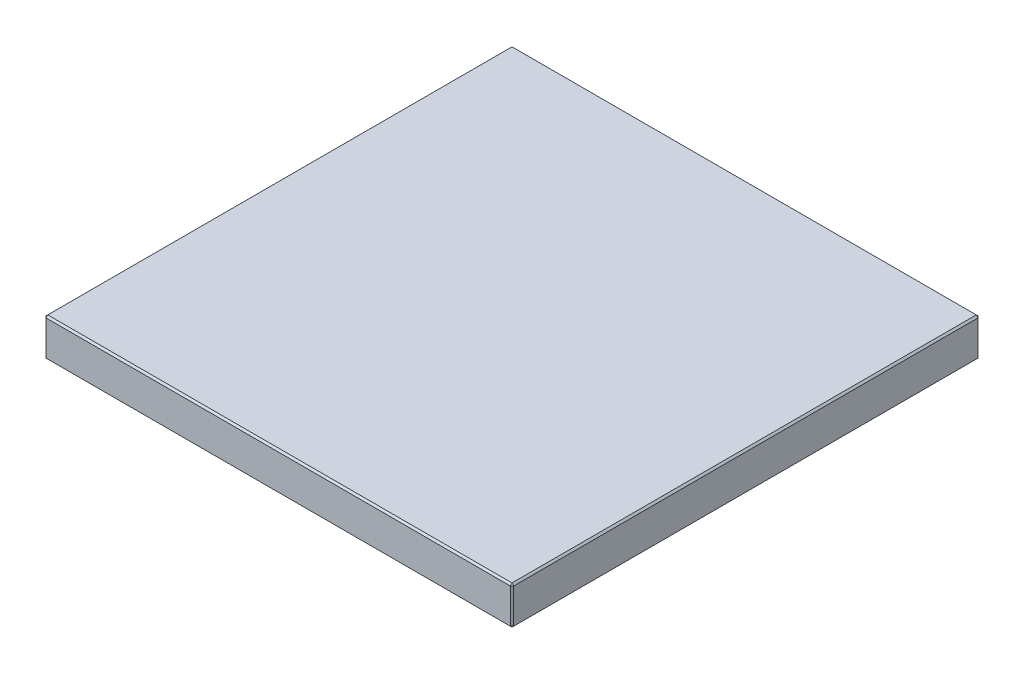
ISO-10303-21;
HEADER;
FILE_DESCRIPTION(('STEP AP214'),'2;1');
FILE_NAME('part.step','',(''),(''),'','','');
FILE_SCHEMA(('AUTOMOTIVE_DESIGN { 1 0 10303 214 1 1 1 1 }'));
ENDSEC;
DATA;
#1=APPLICATION_CONTEXT('core data for automotive mechanical design processes');
#2=APPLICATION_PROTOCOL_DEFINITION('international standard','automotive_design',2000,#1);
#3=PRODUCT_CONTEXT('',#1,'mechanical');
#4=PRODUCT('Part','Part','',(#3));
#5=PRODUCT_RELATED_PRODUCT_CATEGORY('part','',(#4));
#6=PRODUCT_DEFINITION_FORMATION('','',#4);
#7=PRODUCT_DEFINITION_CONTEXT('part definition',#1,'design');
#8=PRODUCT_DEFINITION('design','',#6,#7);
#9=PRODUCT_DEFINITION_SHAPE('','',#8);
#10=(LENGTH_UNIT() NAMED_UNIT(*) SI_UNIT(.MILLI.,.METRE.));
#11=(NAMED_UNIT(*) PLANE_ANGLE_UNIT() SI_UNIT($,.RADIAN.));
#12=(NAMED_UNIT(*) SI_UNIT($,.STERADIAN.) SOLID_ANGLE_UNIT());
#13=UNCERTAINTY_MEASURE_WITH_UNIT(LENGTH_MEASURE(1.E-05),#10,'distance_accuracy_value','');
#14=(GEOMETRIC_REPRESENTATION_CONTEXT(3) GLOBAL_UNCERTAINTY_ASSIGNED_CONTEXT((#13)) GLOBAL_UNIT_ASSIGNED_CONTEXT((#10,
#11,#12)) REPRESENTATION_CONTEXT('',''));
#15=CARTESIAN_POINT('',(0.,0.,0.));
#16=DIRECTION('',(0.,0.,1.));
#17=DIRECTION('',(1.,0.,0.));
#18=AXIS2_PLACEMENT_3D('',#15,#16,#17);
#19=CARTESIAN_POINT('',(-13.42,2.2,-13.42));
#20=DIRECTION('',(1.,0.,0.));
#21=DIRECTION('',(0.,0.,-1.));
#22=AXIS2_PLACEMENT_3D('',#19,#20,#21);
#23=PLANE('',#22);
#24=DIRECTION('',(0.,-1.,0.));
#25=VECTOR('',#24,1.);
#26=CARTESIAN_POINT('',(-13.42,2.2,-13.32));
#27=LINE('',#26,#25);
#28=CARTESIAN_POINT('',(-13.42,2.1,-13.32));
#29=VERTEX_POINT('',#28);
#30=CARTESIAN_POINT('',(-13.42,0.0999999999999994,-13.32));
#31=VERTEX_POINT('',#30);
#32=EDGE_CURVE('E140',#29,#31,#27,.T.);
#33=ORIENTED_EDGE('',*,*,#32,.T.);
#34=DIRECTION('',(0.,0.,1.));
#35=VECTOR('',#34,1.);
#36=CARTESIAN_POINT('',(-13.42,0.0999999999999994,13.42));
#37=LINE('',#36,#35);
#38=CARTESIAN_POINT('',(-13.42,0.0999999999999994,13.32));
#39=VERTEX_POINT('',#38);
#40=EDGE_CURVE('E136',#31,#39,#37,.T.);
#41=ORIENTED_EDGE('',*,*,#40,.T.);
#42=DIRECTION('',(0.,1.,0.));
#43=VECTOR('',#42,1.);
#44=CARTESIAN_POINT('',(-13.42,2.2,13.32));
#45=LINE('',#44,#43);
#46=CARTESIAN_POINT('',(-13.42,2.1,13.32));
#47=VERTEX_POINT('',#46);
#48=EDGE_CURVE('E129',#39,#47,#45,.T.);
#49=ORIENTED_EDGE('',*,*,#48,.T.);
#50=DIRECTION('',(0.,0.,-1.));
#51=VECTOR('',#50,1.);
#52=CARTESIAN_POINT('',(-13.42,2.1,-13.42));
#53=LINE('',#52,#51);
#54=EDGE_CURVE('E135',#47,#29,#53,.T.);
#55=ORIENTED_EDGE('',*,*,#54,.T.);
#56=EDGE_LOOP('',(#33,#41,#49,#55));
#57=FACE_BOUND('',#56,.T.);
#58=ADVANCED_FACE('F37',(#57),#23,.F.);
#59=CARTESIAN_POINT('',(13.42,2.2,13.42));
#60=DIRECTION('',(0.,0.,-1.));
#61=DIRECTION('',(-1.,0.,0.));
#62=AXIS2_PLACEMENT_3D('',#59,#60,#61);
#63=PLANE('',#62);
#64=DIRECTION('',(0.,-1.,0.));
#65=VECTOR('',#64,1.);
#66=CARTESIAN_POINT('',(-13.32,2.2,13.42));
#67=LINE('',#66,#65);
#68=CARTESIAN_POINT('',(-13.32,2.1,13.42));
#69=VERTEX_POINT('',#68);
#70=CARTESIAN_POINT('',(-13.32,0.0999999999999994,13.42));
#71=VERTEX_POINT('',#70);
#72=EDGE_CURVE('E146',#69,#71,#67,.T.);
#73=ORIENTED_EDGE('',*,*,#72,.T.);
#74=DIRECTION('',(1.,0.,0.));
#75=VECTOR('',#74,1.);
#76=CARTESIAN_POINT('',(13.42,0.0999999999999994,13.42));
#77=LINE('',#76,#75);
#78=CARTESIAN_POINT('',(13.32,0.0999999999999994,13.42));
#79=VERTEX_POINT('',#78);
#80=EDGE_CURVE('E189',#71,#79,#77,.T.);
#81=ORIENTED_EDGE('',*,*,#80,.T.);
#82=DIRECTION('',(0.,1.,0.));
#83=VECTOR('',#82,1.);
#84=CARTESIAN_POINT('',(13.32,2.2,13.42));
#85=LINE('',#84,#83);
#86=CARTESIAN_POINT('',(13.32,2.1,13.42));
#87=VERTEX_POINT('',#86);
#88=EDGE_CURVE('E181',#79,#87,#85,.T.);
#89=ORIENTED_EDGE('',*,*,#88,.T.);
#90=DIRECTION('',(-1.,0.,0.));
#91=VECTOR('',#90,1.);
#92=CARTESIAN_POINT('',(13.42,2.1,13.42));
#93=LINE('',#92,#91);
#94=EDGE_CURVE('E182',#87,#69,#93,.T.);
#95=ORIENTED_EDGE('',*,*,#94,.T.);
#96=EDGE_LOOP('',(#73,#81,#89,#95));
#97=FACE_BOUND('',#96,.T.);
#98=ADVANCED_FACE('F304',(#97),#63,.F.);
#99=CARTESIAN_POINT('',(13.42,2.2,-13.42));
#100=DIRECTION('',(-1.,0.,0.));
#101=DIRECTION('',(0.,0.,1.));
#102=AXIS2_PLACEMENT_3D('',#99,#100,#101);
#103=PLANE('',#102);
#104=DIRECTION('',(0.,0.,1.));
#105=VECTOR('',#104,1.);
#106=CARTESIAN_POINT('',(13.42,2.1,-13.42));
#107=LINE('',#106,#105);
#108=CARTESIAN_POINT('',(13.42,2.1,-13.32));
#109=VERTEX_POINT('',#108);
#110=CARTESIAN_POINT('',(13.42,2.1,13.32));
#111=VERTEX_POINT('',#110);
#112=EDGE_CURVE('E190',#109,#111,#107,.T.);
#113=ORIENTED_EDGE('',*,*,#112,.T.);
#114=DIRECTION('',(0.,-1.,0.));
#115=VECTOR('',#114,1.);
#116=CARTESIAN_POINT('',(13.42,2.2,13.32));
#117=LINE('',#116,#115);
#118=CARTESIAN_POINT('',(13.42,0.0999999999999994,13.32));
#119=VERTEX_POINT('',#118);
#120=EDGE_CURVE('E193',#111,#119,#117,.T.);
#121=ORIENTED_EDGE('',*,*,#120,.T.);
#122=DIRECTION('',(0.,0.,-1.));
#123=VECTOR('',#122,1.);
#124=CARTESIAN_POINT('',(13.42,0.0999999999999994,-13.42));
#125=LINE('',#124,#123);
#126=CARTESIAN_POINT('',(13.42,0.0999999999999994,-13.32));
#127=VERTEX_POINT('',#126);
#128=EDGE_CURVE('E192',#119,#127,#125,.T.);
#129=ORIENTED_EDGE('',*,*,#128,.T.);
#130=DIRECTION('',(0.,1.,0.));
#131=VECTOR('',#130,1.);
#132=CARTESIAN_POINT('',(13.42,2.2,-13.32));
#133=LINE('',#132,#131);
#134=EDGE_CURVE('E187',#127,#109,#133,.T.);
#135=ORIENTED_EDGE('',*,*,#134,.T.);
#136=EDGE_LOOP('',(#113,#121,#129,#135));
#137=FACE_BOUND('',#136,.T.);
#138=ADVANCED_FACE('F278',(#137),#103,.F.);
#139=CARTESIAN_POINT('',(13.42,2.2,-13.42));
#140=DIRECTION('',(0.,0.,1.));
#141=DIRECTION('',(1.,0.,0.));
#142=AXIS2_PLACEMENT_3D('',#139,#140,#141);
#143=PLANE('',#142);
#144=DIRECTION('',(-1.,0.,0.));
#145=VECTOR('',#144,1.);
#146=CARTESIAN_POINT('',(-13.42,0.0999999999999994,-13.42));
#147=LINE('',#146,#145);
#148=CARTESIAN_POINT('',(13.32,0.0999999999999994,-13.42));
#149=VERTEX_POINT('',#148);
#150=CARTESIAN_POINT('',(-13.32,0.0999999999999994,-13.42));
#151=VERTEX_POINT('',#150);
#152=EDGE_CURVE('E176',#149,#151,#147,.T.);
#153=ORIENTED_EDGE('',*,*,#152,.T.);
#154=DIRECTION('',(0.,1.,0.));
#155=VECTOR('',#154,1.);
#156=CARTESIAN_POINT('',(-13.32,2.2,-13.42));
#157=LINE('',#156,#155);
#158=CARTESIAN_POINT('',(-13.32,2.1,-13.42));
#159=VERTEX_POINT('',#158);
#160=EDGE_CURVE('E179',#151,#159,#157,.T.);
#161=ORIENTED_EDGE('',*,*,#160,.T.);
#162=DIRECTION('',(1.,0.,0.));
#163=VECTOR('',#162,1.);
#164=CARTESIAN_POINT('',(13.42,2.1,-13.42));
#165=LINE('',#164,#163);
#166=CARTESIAN_POINT('',(13.32,2.1,-13.42));
#167=VERTEX_POINT('',#166);
#168=EDGE_CURVE('E171',#159,#167,#165,.T.);
#169=ORIENTED_EDGE('',*,*,#168,.T.);
#170=DIRECTION('',(0.,-1.,0.));
#171=VECTOR('',#170,1.);
#172=CARTESIAN_POINT('',(13.32,2.2,-13.42));
#173=LINE('',#172,#171);
#174=EDGE_CURVE('E173',#167,#149,#173,.T.);
#175=ORIENTED_EDGE('',*,*,#174,.T.);
#176=EDGE_LOOP('',(#153,#161,#169,#175));
#177=FACE_BOUND('',#176,.T.);
#178=ADVANCED_FACE('F309',(#177),#143,.F.);
#179=CARTESIAN_POINT('',(0.,2.2,0.));
#180=DIRECTION('',(0.,-1.,0.));
#181=DIRECTION('',(0.,0.,-1.));
#182=AXIS2_PLACEMENT_3D('',#179,#180,#181);
#183=PLANE('',#182);
#184=DIRECTION('',(0.,0.,-1.));
#185=VECTOR('',#184,1.);
#186=CARTESIAN_POINT('',(13.32,2.2,0.));
#187=LINE('',#186,#185);
#188=CARTESIAN_POINT('',(13.32,2.2,13.32));
#189=VERTEX_POINT('',#188);
#190=CARTESIAN_POINT('',(13.32,2.2,-13.32));
#191=VERTEX_POINT('',#190);
#192=EDGE_CURVE('E49',#189,#191,#187,.T.);
#193=ORIENTED_EDGE('',*,*,#192,.T.);
#194=DIRECTION('',(-1.,0.,0.));
#195=VECTOR('',#194,1.);
#196=CARTESIAN_POINT('',(0.,2.2,-13.32));
#197=LINE('',#196,#195);
#198=CARTESIAN_POINT('',(-13.32,2.2,-13.32));
#199=VERTEX_POINT('',#198);
#200=EDGE_CURVE('E11',#191,#199,#197,.T.);
#201=ORIENTED_EDGE('',*,*,#200,.T.);
#202=DIRECTION('',(0.,0.,1.));
#203=VECTOR('',#202,1.);
#204=CARTESIAN_POINT('',(-13.32,2.2,0.));
#205=LINE('',#204,#203);
#206=CARTESIAN_POINT('',(-13.32,2.2,13.32));
#207=VERTEX_POINT('',#206);
#208=EDGE_CURVE('E206',#199,#207,#205,.T.);
#209=ORIENTED_EDGE('',*,*,#208,.T.);
#210=DIRECTION('',(1.,0.,0.));
#211=VECTOR('',#210,1.);
#212=CARTESIAN_POINT('',(0.,2.2,13.32));
#213=LINE('',#212,#211);
#214=EDGE_CURVE('E64',#207,#189,#213,.T.);
#215=ORIENTED_EDGE('',*,*,#214,.T.);
#216=EDGE_LOOP('',(#193,#201,#209,#215));
#217=FACE_BOUND('',#216,.T.);
#218=ADVANCED_FACE('F429',(#217),#183,.F.);
#219=CARTESIAN_POINT('',(0.,0.,0.));
#220=DIRECTION('',(0.,-1.,0.));
#221=DIRECTION('',(0.,0.,-1.));
#222=AXIS2_PLACEMENT_3D('',#219,#220,#221);
#223=PLANE('',#222);
#224=DIRECTION('',(0.,0.,1.));
#225=VECTOR('',#224,1.);
#226=CARTESIAN_POINT('',(13.32,0.,13.42));
#227=LINE('',#226,#225);
#228=CARTESIAN_POINT('',(13.32,0.,-13.32));
#229=VERTEX_POINT('',#228);
#230=CARTESIAN_POINT('',(13.32,0.,13.32));
#231=VERTEX_POINT('',#230);
#232=EDGE_CURVE('E203',#229,#231,#227,.T.);
#233=ORIENTED_EDGE('',*,*,#232,.T.);
#234=DIRECTION('',(-1.,0.,0.));
#235=VECTOR('',#234,1.);
#236=CARTESIAN_POINT('',(-13.42,0.,13.32));
#237=LINE('',#236,#235);
#238=CARTESIAN_POINT('',(-13.32,0.,13.32));
#239=VERTEX_POINT('',#238);
#240=EDGE_CURVE('E201',#231,#239,#237,.T.);
#241=ORIENTED_EDGE('',*,*,#240,.T.);
#242=DIRECTION('',(0.,0.,-1.));
#243=VECTOR('',#242,1.);
#244=CARTESIAN_POINT('',(-13.32,0.,-13.42));
#245=LINE('',#244,#243);
#246=CARTESIAN_POINT('',(-13.32,0.,-13.32));
#247=VERTEX_POINT('',#246);
#248=EDGE_CURVE('E200',#239,#247,#245,.T.);
#249=ORIENTED_EDGE('',*,*,#248,.T.);
#250=DIRECTION('',(1.,0.,0.));
#251=VECTOR('',#250,1.);
#252=CARTESIAN_POINT('',(13.42,0.,-13.32));
#253=LINE('',#252,#251);
#254=EDGE_CURVE('E197',#247,#229,#253,.T.);
#255=ORIENTED_EDGE('',*,*,#254,.T.);
#256=EDGE_LOOP('',(#233,#241,#249,#255));
#257=FACE_BOUND('',#256,.T.);
#258=ADVANCED_FACE('F275',(#257),#223,.T.);
#259=CARTESIAN_POINT('',(13.42,2.2,13.32));
#260=DIRECTION('',(-0.707106781186554,0.,-0.707106781186541));
#261=DIRECTION('',(0.,-1.,0.));
#262=AXIS2_PLACEMENT_3D('',#259,#260,#261);
#263=PLANE('',#262);
#264=DIRECTION('',(-0.707106781186541,0.,0.707106781186554));
#265=VECTOR('',#264,1.);
#266=CARTESIAN_POINT('',(13.32,2.1,13.42));
#267=LINE('',#266,#265);
#268=EDGE_CURVE('E44',#87,#111,#267,.F.);
#269=ORIENTED_EDGE('',*,*,#268,.F.);
#270=ORIENTED_EDGE('',*,*,#88,.F.);
#271=DIRECTION('',(0.707106781186541,0.,-0.707106781186554));
#272=VECTOR('',#271,1.);
#273=CARTESIAN_POINT('',(13.42,0.0999999999999994,13.32));
#274=LINE('',#273,#272);
#275=EDGE_CURVE('E169',#119,#79,#274,.F.);
#276=ORIENTED_EDGE('',*,*,#275,.F.);
#277=ORIENTED_EDGE('',*,*,#120,.F.);
#278=EDGE_LOOP('',(#269,#270,#276,#277));
#279=FACE_BOUND('',#278,.T.);
#280=ADVANCED_FACE('F43',(#279),#263,.F.);
#281=CARTESIAN_POINT('',(13.32,2.1,13.42));
#282=DIRECTION('',(0.577350269189629,0.577350269189629,0.577350269189619));
#283=DIRECTION('',(-0.707106781186548,0.707106781186548,0.));
#284=AXIS2_PLACEMENT_3D('',#281,#282,#283);
#285=PLANE('',#284);
#286=DIRECTION('',(0.,0.707106781186548,-0.707106781186548));
#287=VECTOR('',#286,1.);
#288=CARTESIAN_POINT('',(13.32,2.1,13.42));
#289=LINE('',#288,#287);
#290=EDGE_CURVE('E251',#87,#189,#289,.T.);
#291=ORIENTED_EDGE('',*,*,#290,.F.);
#292=ORIENTED_EDGE('',*,*,#268,.T.);
#293=DIRECTION('',(0.707106781186557,-0.707106781186538,0.));
#294=VECTOR('',#293,1.);
#295=CARTESIAN_POINT('',(13.37,2.15,13.32));
#296=LINE('',#295,#294);
#297=EDGE_CURVE('E254',#189,#111,#296,.T.);
#298=ORIENTED_EDGE('',*,*,#297,.F.);
#299=EDGE_LOOP('',(#291,#292,#298));
#300=FACE_BOUND('',#299,.T.);
#301=ADVANCED_FACE('F300',(#300),#285,.T.);
#302=CARTESIAN_POINT('',(13.42,0.0999999999999994,13.32));
#303=DIRECTION('',(0.577350269189629,-0.577350269189629,0.577350269189619));
#304=DIRECTION('',(0.707106781186548,0.707106781186548,0.));
#305=AXIS2_PLACEMENT_3D('',#302,#303,#304);
#306=PLANE('',#305);
#307=DIRECTION('',(0.707106781186557,0.707106781186538,0.));
#308=VECTOR('',#307,1.);
#309=CARTESIAN_POINT('',(13.42,0.0999999999999994,13.32));
#310=LINE('',#309,#308);
#311=EDGE_CURVE('E247',#119,#231,#310,.F.);
#312=ORIENTED_EDGE('',*,*,#311,.F.);
#313=ORIENTED_EDGE('',*,*,#275,.T.);
#314=DIRECTION('',(0.,-0.707106781186548,-0.707106781186548));
#315=VECTOR('',#314,1.);
#316=CARTESIAN_POINT('',(13.32,0.0499999999999997,13.37));
#317=LINE('',#316,#315);
#318=EDGE_CURVE('E250',#231,#79,#317,.F.);
#319=ORIENTED_EDGE('',*,*,#318,.F.);
#320=EDGE_LOOP('',(#312,#313,#319));
#321=FACE_BOUND('',#320,.T.);
#322=ADVANCED_FACE('F265',(#321),#306,.T.);
#323=CARTESIAN_POINT('',(13.32,2.2,0.));
#324=DIRECTION('',(-0.707106781186538,-0.707106781186557,0.));
#325=DIRECTION('',(0.,0.,-1.));
#326=AXIS2_PLACEMENT_3D('',#323,#324,#325);
#327=PLANE('',#326);
#328=ORIENTED_EDGE('',*,*,#297,.T.);
#329=ORIENTED_EDGE('',*,*,#112,.F.);
#330=DIRECTION('',(-0.707106781186557,0.707106781186538,0.));
#331=VECTOR('',#330,1.);
#332=CARTESIAN_POINT('',(13.42,2.1,-13.32));
#333=LINE('',#332,#331);
#334=EDGE_CURVE('E244',#191,#109,#333,.F.);
#335=ORIENTED_EDGE('',*,*,#334,.F.);
#336=ORIENTED_EDGE('',*,*,#192,.F.);
#337=EDGE_LOOP('',(#328,#329,#335,#336));
#338=FACE_BOUND('',#337,.T.);
#339=ADVANCED_FACE('F291',(#338),#327,.F.);
#340=CARTESIAN_POINT('',(0.,2.2,13.32));
#341=DIRECTION('',(0.,-0.707106781186548,-0.707106781186548));
#342=DIRECTION('',(1.,0.,0.));
#343=AXIS2_PLACEMENT_3D('',#340,#341,#342);
#344=PLANE('',#343);
#345=ORIENTED_EDGE('',*,*,#290,.T.);
#346=ORIENTED_EDGE('',*,*,#214,.F.);
#347=DIRECTION('',(0.,-0.707106781186547,0.707106781186547));
#348=VECTOR('',#347,1.);
#349=CARTESIAN_POINT('',(-13.32,2.15,13.37));
#350=LINE('',#349,#348);
#351=EDGE_CURVE('E155',#69,#207,#350,.F.);
#352=ORIENTED_EDGE('',*,*,#351,.F.);
#353=ORIENTED_EDGE('',*,*,#94,.F.);
#354=EDGE_LOOP('',(#345,#346,#352,#353));
#355=FACE_BOUND('',#354,.T.);
#356=ADVANCED_FACE('F301',(#355),#344,.F.);
#357=CARTESIAN_POINT('',(-13.32,2.2,13.42));
#358=DIRECTION('',(0.707106781186541,0.,-0.707106781186554));
#359=DIRECTION('',(0.,-1.,0.));
#360=AXIS2_PLACEMENT_3D('',#357,#358,#359);
#361=PLANE('',#360);
#362=DIRECTION('',(0.707106781186554,0.,0.707106781186541));
#363=VECTOR('',#362,1.);
#364=CARTESIAN_POINT('',(-13.32,0.0999999999999994,13.42));
#365=LINE('',#364,#363);
#366=EDGE_CURVE('E153',#71,#39,#365,.F.);
#367=ORIENTED_EDGE('',*,*,#366,.F.);
#368=ORIENTED_EDGE('',*,*,#72,.F.);
#369=DIRECTION('',(-0.707106781186554,0.,-0.707106781186541));
#370=VECTOR('',#369,1.);
#371=CARTESIAN_POINT('',(-13.42,2.1,13.32));
#372=LINE('',#371,#370);
#373=EDGE_CURVE('E145',#47,#69,#372,.F.);
#374=ORIENTED_EDGE('',*,*,#373,.F.);
#375=ORIENTED_EDGE('',*,*,#48,.F.);
#376=EDGE_LOOP('',(#367,#368,#374,#375));
#377=FACE_BOUND('',#376,.T.);
#378=ADVANCED_FACE('F148',(#377),#361,.F.);
#379=CARTESIAN_POINT('',(13.42,0.0999999999999994,13.42));
#380=DIRECTION('',(0.,-0.707106781186548,0.707106781186548));
#381=DIRECTION('',(-1.,0.,0.));
#382=AXIS2_PLACEMENT_3D('',#379,#380,#381);
#383=PLANE('',#382);
#384=ORIENTED_EDGE('',*,*,#318,.T.);
#385=ORIENTED_EDGE('',*,*,#80,.F.);
#386=DIRECTION('',(0.,0.707106781186547,0.707106781186547));
#387=VECTOR('',#386,1.);
#388=CARTESIAN_POINT('',(-13.32,0.0999999999999994,13.42));
#389=LINE('',#388,#387);
#390=EDGE_CURVE('E240',#239,#71,#389,.T.);
#391=ORIENTED_EDGE('',*,*,#390,.F.);
#392=ORIENTED_EDGE('',*,*,#240,.F.);
#393=EDGE_LOOP('',(#384,#385,#391,#392));
#394=FACE_BOUND('',#393,.T.);
#395=ADVANCED_FACE('F267',(#394),#383,.T.);
#396=CARTESIAN_POINT('',(13.42,0.0999999999999994,-13.42));
#397=DIRECTION('',(0.707106781186538,-0.707106781186557,0.));
#398=DIRECTION('',(0.,0.,1.));
#399=AXIS2_PLACEMENT_3D('',#396,#397,#398);
#400=PLANE('',#399);
#401=ORIENTED_EDGE('',*,*,#311,.T.);
#402=ORIENTED_EDGE('',*,*,#232,.F.);
#403=DIRECTION('',(-0.707106781186557,-0.707106781186538,0.));
#404=VECTOR('',#403,1.);
#405=CARTESIAN_POINT('',(13.42,0.0999999999999994,-13.32));
#406=LINE('',#405,#404);
#407=EDGE_CURVE('E233',#127,#229,#406,.T.);
#408=ORIENTED_EDGE('',*,*,#407,.F.);
#409=ORIENTED_EDGE('',*,*,#128,.F.);
#410=EDGE_LOOP('',(#401,#402,#408,#409));
#411=FACE_BOUND('',#410,.T.);
#412=ADVANCED_FACE('F280',(#411),#400,.T.);
#413=CARTESIAN_POINT('',(13.32,2.2,-13.42));
#414=DIRECTION('',(-0.707106781186548,0.,0.707106781186548));
#415=DIRECTION('',(0.,-1.,0.));
#416=AXIS2_PLACEMENT_3D('',#413,#414,#415);
#417=PLANE('',#416);
#418=DIRECTION('',(0.707106781186548,0.,0.707106781186548));
#419=VECTOR('',#418,1.);
#420=CARTESIAN_POINT('',(13.42,2.1,-13.32));
#421=LINE('',#420,#419);
#422=EDGE_CURVE('E243',#109,#167,#421,.F.);
#423=ORIENTED_EDGE('',*,*,#422,.F.);
#424=ORIENTED_EDGE('',*,*,#134,.F.);
#425=DIRECTION('',(-0.707106781186548,0.,-0.707106781186548));
#426=VECTOR('',#425,1.);
#427=CARTESIAN_POINT('',(13.42,0.0999999999999994,-13.32));
#428=LINE('',#427,#426);
#429=EDGE_CURVE('E231',#149,#127,#428,.F.);
#430=ORIENTED_EDGE('',*,*,#429,.F.);
#431=ORIENTED_EDGE('',*,*,#174,.F.);
#432=EDGE_LOOP('',(#423,#424,#430,#431));
#433=FACE_BOUND('',#432,.T.);
#434=ADVANCED_FACE('F282',(#433),#417,.F.);
#435=CARTESIAN_POINT('',(13.42,2.1,-13.32));
#436=DIRECTION('',(0.577350269189622,0.577350269189632,-0.577350269189622));
#437=DIRECTION('',(0.,0.707106781186541,0.707106781186554));
#438=AXIS2_PLACEMENT_3D('',#435,#436,#437);
#439=PLANE('',#438);
#440=ORIENTED_EDGE('',*,*,#334,.T.);
#441=ORIENTED_EDGE('',*,*,#422,.T.);
#442=DIRECTION('',(0.,-0.707106781186548,-0.707106781186548));
#443=VECTOR('',#442,1.);
#444=CARTESIAN_POINT('',(13.32,2.15,-13.37));
#445=LINE('',#444,#443);
#446=EDGE_CURVE('E159',#191,#167,#445,.T.);
#447=ORIENTED_EDGE('',*,*,#446,.F.);
#448=EDGE_LOOP('',(#440,#441,#447));
#449=FACE_BOUND('',#448,.T.);
#450=ADVANCED_FACE('F290',(#449),#439,.T.);
#451=CARTESIAN_POINT('',(-13.42,2.1,13.32));
#452=DIRECTION('',(-0.577350269189619,0.577350269189629,0.577350269189629));
#453=DIRECTION('',(0.,-0.707106781186548,0.707106781186548));
#454=AXIS2_PLACEMENT_3D('',#451,#452,#453);
#455=PLANE('',#454);
#456=ORIENTED_EDGE('',*,*,#373,.T.);
#457=ORIENTED_EDGE('',*,*,#351,.T.);
#458=DIRECTION('',(0.707106781186548,0.707106781186548,0.));
#459=VECTOR('',#458,1.);
#460=CARTESIAN_POINT('',(-13.42,2.1,13.32));
#461=LINE('',#460,#459);
#462=EDGE_CURVE('E156',#47,#207,#461,.T.);
#463=ORIENTED_EDGE('',*,*,#462,.F.);
#464=EDGE_LOOP('',(#456,#457,#463));
#465=FACE_BOUND('',#464,.T.);
#466=ADVANCED_FACE('F160',(#465),#455,.T.);
#467=CARTESIAN_POINT('',(-13.32,0.0999999999999994,13.42));
#468=DIRECTION('',(-0.577350269189619,-0.577350269189629,0.577350269189629));
#469=DIRECTION('',(0.,-0.707106781186548,-0.707106781186548));
#470=AXIS2_PLACEMENT_3D('',#467,#468,#469);
#471=PLANE('',#470);
#472=ORIENTED_EDGE('',*,*,#390,.T.);
#473=ORIENTED_EDGE('',*,*,#366,.T.);
#474=DIRECTION('',(0.707106781186548,-0.707106781186548,0.));
#475=VECTOR('',#474,1.);
#476=CARTESIAN_POINT('',(-13.37,0.0500000000000005,13.32));
#477=LINE('',#476,#475);
#478=EDGE_CURVE('E161',#239,#39,#477,.F.);
#479=ORIENTED_EDGE('',*,*,#478,.F.);
#480=EDGE_LOOP('',(#472,#473,#479));
#481=FACE_BOUND('',#480,.T.);
#482=ADVANCED_FACE('F369',(#481),#471,.T.);
#483=CARTESIAN_POINT('',(13.42,0.0999999999999994,-13.32));
#484=DIRECTION('',(0.577350269189622,-0.577350269189632,-0.577350269189622));
#485=DIRECTION('',(0.,0.707106781186541,-0.707106781186554));
#486=AXIS2_PLACEMENT_3D('',#483,#484,#485);
#487=PLANE('',#486);
#488=ORIENTED_EDGE('',*,*,#429,.T.);
#489=ORIENTED_EDGE('',*,*,#407,.T.);
#490=DIRECTION('',(0.,0.707106781186548,-0.707106781186548));
#491=VECTOR('',#490,1.);
#492=CARTESIAN_POINT('',(13.32,0.0500000000000006,-13.37));
#493=LINE('',#492,#491);
#494=EDGE_CURVE('E221',#149,#229,#493,.F.);
#495=ORIENTED_EDGE('',*,*,#494,.F.);
#496=EDGE_LOOP('',(#488,#489,#495));
#497=FACE_BOUND('',#496,.T.);
#498=ADVANCED_FACE('F362',(#497),#487,.T.);
#499=CARTESIAN_POINT('',(0.,2.2,-13.32));
#500=DIRECTION('',(0.,-0.707106781186548,0.707106781186548));
#501=DIRECTION('',(-1.,0.,0.));
#502=AXIS2_PLACEMENT_3D('',#499,#500,#501);
#503=PLANE('',#502);
#504=ORIENTED_EDGE('',*,*,#446,.T.);
#505=ORIENTED_EDGE('',*,*,#168,.F.);
#506=DIRECTION('',(0.,0.707106781186548,0.707106781186548));
#507=VECTOR('',#506,1.);
#508=CARTESIAN_POINT('',(-13.32,2.1,-13.42));
#509=LINE('',#508,#507);
#510=EDGE_CURVE('E222',#199,#159,#509,.F.);
#511=ORIENTED_EDGE('',*,*,#510,.F.);
#512=ORIENTED_EDGE('',*,*,#200,.F.);
#513=EDGE_LOOP('',(#504,#505,#511,#512));
#514=FACE_BOUND('',#513,.T.);
#515=ADVANCED_FACE('F356',(#514),#503,.F.);
#516=CARTESIAN_POINT('',(-13.32,2.2,0.));
#517=DIRECTION('',(0.707106781186548,-0.707106781186548,0.));
#518=DIRECTION('',(0.,0.,1.));
#519=AXIS2_PLACEMENT_3D('',#516,#517,#518);
#520=PLANE('',#519);
#521=ORIENTED_EDGE('',*,*,#462,.T.);
#522=ORIENTED_EDGE('',*,*,#208,.F.);
#523=DIRECTION('',(-0.707106781186547,-0.707106781186547,0.));
#524=VECTOR('',#523,1.);
#525=CARTESIAN_POINT('',(-13.37,2.15,-13.32));
#526=LINE('',#525,#524);
#527=EDGE_CURVE('E163',#29,#199,#526,.F.);
#528=ORIENTED_EDGE('',*,*,#527,.F.);
#529=ORIENTED_EDGE('',*,*,#54,.F.);
#530=EDGE_LOOP('',(#521,#522,#528,#529));
#531=FACE_BOUND('',#530,.T.);
#532=ADVANCED_FACE('F162',(#531),#520,.F.);
#533=CARTESIAN_POINT('',(-13.42,0.0999999999999994,-13.42));
#534=DIRECTION('',(-0.707106781186548,-0.707106781186548,0.));
#535=DIRECTION('',(0.,0.,-1.));
#536=AXIS2_PLACEMENT_3D('',#533,#534,#535);
#537=PLANE('',#536);
#538=ORIENTED_EDGE('',*,*,#478,.T.);
#539=ORIENTED_EDGE('',*,*,#40,.F.);
#540=DIRECTION('',(-0.707106781186547,0.707106781186547,0.));
#541=VECTOR('',#540,1.);
#542=CARTESIAN_POINT('',(-13.42,0.0999999999999994,-13.32));
#543=LINE('',#542,#541);
#544=EDGE_CURVE('E220',#247,#31,#543,.T.);
#545=ORIENTED_EDGE('',*,*,#544,.F.);
#546=ORIENTED_EDGE('',*,*,#248,.F.);
#547=EDGE_LOOP('',(#538,#539,#545,#546));
#548=FACE_BOUND('',#547,.T.);
#549=ADVANCED_FACE('F344',(#548),#537,.T.);
#550=CARTESIAN_POINT('',(13.42,0.0999999999999994,-13.42));
#551=DIRECTION('',(0.,-0.707106781186548,-0.707106781186548));
#552=DIRECTION('',(1.,0.,0.));
#553=AXIS2_PLACEMENT_3D('',#550,#551,#552);
#554=PLANE('',#553);
#555=ORIENTED_EDGE('',*,*,#494,.T.);
#556=ORIENTED_EDGE('',*,*,#254,.F.);
#557=DIRECTION('',(0.,-0.707106781186548,0.707106781186548));
#558=VECTOR('',#557,1.);
#559=CARTESIAN_POINT('',(-13.32,0.0499999999999988,-13.37));
#560=LINE('',#559,#558);
#561=EDGE_CURVE('E212',#151,#247,#560,.T.);
#562=ORIENTED_EDGE('',*,*,#561,.F.);
#563=ORIENTED_EDGE('',*,*,#152,.F.);
#564=EDGE_LOOP('',(#555,#556,#562,#563));
#565=FACE_BOUND('',#564,.T.);
#566=ADVANCED_FACE('F339',(#565),#554,.T.);
#567=CARTESIAN_POINT('',(-13.32,2.1,-13.42));
#568=DIRECTION('',(-0.577350269189622,0.577350269189622,-0.577350269189632));
#569=DIRECTION('',(-0.707106781186554,0.,0.707106781186541));
#570=AXIS2_PLACEMENT_3D('',#567,#568,#569);
#571=PLANE('',#570);
#572=ORIENTED_EDGE('',*,*,#527,.T.);
#573=ORIENTED_EDGE('',*,*,#510,.T.);
#574=DIRECTION('',(0.707106781186554,0.,-0.707106781186541));
#575=VECTOR('',#574,1.);
#576=CARTESIAN_POINT('',(-13.32,2.1,-13.42));
#577=LINE('',#576,#575);
#578=EDGE_CURVE('E215',#29,#159,#577,.T.);
#579=ORIENTED_EDGE('',*,*,#578,.F.);
#580=EDGE_LOOP('',(#572,#573,#579));
#581=FACE_BOUND('',#580,.T.);
#582=ADVANCED_FACE('F328',(#581),#571,.T.);
#583=CARTESIAN_POINT('',(-13.42,0.0999999999999994,-13.32));
#584=DIRECTION('',(-0.577350269189622,-0.577350269189622,-0.577350269189632));
#585=DIRECTION('',(-0.707106781186554,0.,0.707106781186541));
#586=AXIS2_PLACEMENT_3D('',#583,#584,#585);
#587=PLANE('',#586);
#588=ORIENTED_EDGE('',*,*,#561,.T.);
#589=ORIENTED_EDGE('',*,*,#544,.T.);
#590=DIRECTION('',(-0.707106781186554,0.,0.707106781186541));
#591=VECTOR('',#590,1.);
#592=CARTESIAN_POINT('',(-13.42,0.0999999999999994,-13.32));
#593=LINE('',#592,#591);
#594=EDGE_CURVE('E209',#151,#31,#593,.T.);
#595=ORIENTED_EDGE('',*,*,#594,.F.);
#596=EDGE_LOOP('',(#588,#589,#595));
#597=FACE_BOUND('',#596,.T.);
#598=ADVANCED_FACE('F325',(#597),#587,.T.);
#599=CARTESIAN_POINT('',(-13.42,2.2,-13.32));
#600=DIRECTION('',(0.707106781186541,0.,0.707106781186554));
#601=DIRECTION('',(0.,-1.,0.));
#602=AXIS2_PLACEMENT_3D('',#599,#600,#601);
#603=PLANE('',#602);
#604=ORIENTED_EDGE('',*,*,#578,.T.);
#605=ORIENTED_EDGE('',*,*,#160,.F.);
#606=ORIENTED_EDGE('',*,*,#594,.T.);
#607=ORIENTED_EDGE('',*,*,#32,.F.);
#608=EDGE_LOOP('',(#604,#605,#606,#607));
#609=FACE_BOUND('',#608,.T.);
#610=ADVANCED_FACE('F316',(#609),#603,.F.);
#611=CLOSED_SHELL('',(#58,#98,#138,#178,#218,#258,#280,#301,#322,#339,#356,#378,#395,#412,#434,
#450,#466,#482,#498,#515,#532,#549,#566,#582,#598,#610));
#612=MANIFOLD_SOLID_BREP('B2',#611);
#613=ADVANCED_BREP_SHAPE_REPRESENTATION('',(#18,#612),#14);
#614=SHAPE_DEFINITION_REPRESENTATION(#9,#613);
ENDSEC;
END-ISO-10303-21;
